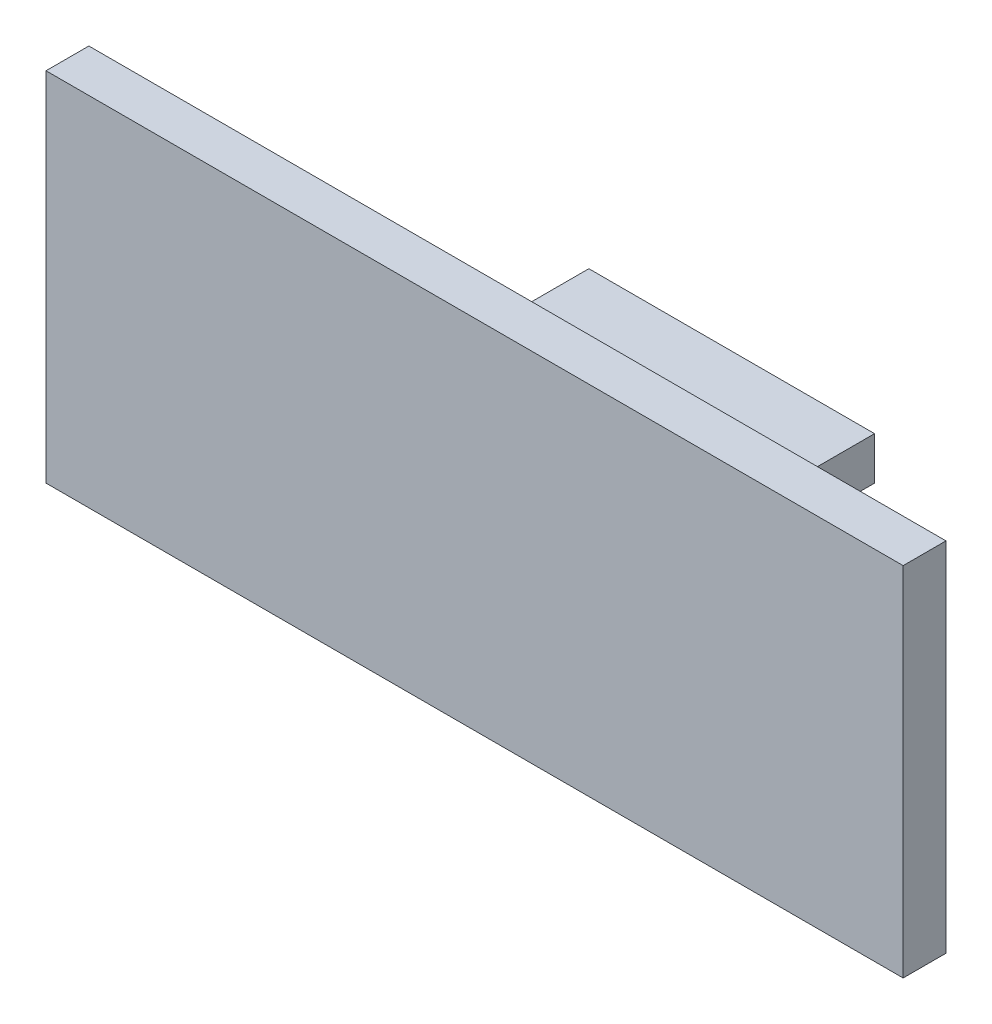
ISO-10303-21;
HEADER;
FILE_DESCRIPTION(('STEP AP214'),'2;1');
FILE_NAME('part.step','',(''),(''),'','','');
FILE_SCHEMA(('AUTOMOTIVE_DESIGN { 1 0 10303 214 1 1 1 1 }'));
ENDSEC;
DATA;
#1=APPLICATION_CONTEXT('core data for automotive mechanical design processes');
#2=APPLICATION_PROTOCOL_DEFINITION('international standard','automotive_design',2000,#1);
#3=PRODUCT_CONTEXT('',#1,'mechanical');
#4=PRODUCT('Part','Part','',(#3));
#5=PRODUCT_RELATED_PRODUCT_CATEGORY('part','',(#4));
#6=PRODUCT_DEFINITION_FORMATION('','',#4);
#7=PRODUCT_DEFINITION_CONTEXT('part definition',#1,'design');
#8=PRODUCT_DEFINITION('design','',#6,#7);
#9=PRODUCT_DEFINITION_SHAPE('','',#8);
#10=(LENGTH_UNIT() NAMED_UNIT(*) SI_UNIT(.MILLI.,.METRE.));
#11=(NAMED_UNIT(*) PLANE_ANGLE_UNIT() SI_UNIT($,.RADIAN.));
#12=(NAMED_UNIT(*) SI_UNIT($,.STERADIAN.) SOLID_ANGLE_UNIT());
#13=UNCERTAINTY_MEASURE_WITH_UNIT(LENGTH_MEASURE(1.E-05),#10,'distance_accuracy_value','');
#14=(GEOMETRIC_REPRESENTATION_CONTEXT(3) GLOBAL_UNCERTAINTY_ASSIGNED_CONTEXT((#13)) GLOBAL_UNIT_ASSIGNED_CONTEXT((#10,
#11,#12)) REPRESENTATION_CONTEXT('',''));
#15=CARTESIAN_POINT('',(0.,0.,0.));
#16=DIRECTION('',(0.,0.,1.));
#17=DIRECTION('',(1.,0.,0.));
#18=AXIS2_PLACEMENT_3D('',#15,#16,#17);
#19=CARTESIAN_POINT('',(30.,12.5,5.));
#20=DIRECTION('',(-1.,0.,0.));
#21=DIRECTION('',(0.,0.,1.));
#22=AXIS2_PLACEMENT_3D('',#19,#20,#21);
#23=PLANE('',#22);
#24=DIRECTION('',(0.,1.,0.));
#25=VECTOR('',#24,1.);
#26=CARTESIAN_POINT('',(30.,-12.5,3.));
#27=LINE('',#26,#25);
#28=CARTESIAN_POINT('',(30.,-12.5,3.));
#29=VERTEX_POINT('',#28);
#30=CARTESIAN_POINT('',(30.,12.5,3.));
#31=VERTEX_POINT('',#30);
#32=EDGE_CURVE('E129',#29,#31,#27,.T.);
#33=ORIENTED_EDGE('',*,*,#32,.F.);
#34=DIRECTION('',(0.,0.,-1.));
#35=VECTOR('',#34,1.);
#36=CARTESIAN_POINT('',(30.,-12.5,5.));
#37=LINE('',#36,#35);
#38=CARTESIAN_POINT('',(30.,-12.5,0.));
#39=VERTEX_POINT('',#38);
#40=EDGE_CURVE('E156',#29,#39,#37,.T.);
#41=ORIENTED_EDGE('',*,*,#40,.T.);
#42=DIRECTION('',(0.,1.,0.));
#43=VECTOR('',#42,1.);
#44=CARTESIAN_POINT('',(30.,12.5,0.));
#45=LINE('',#44,#43);
#46=CARTESIAN_POINT('',(30.,12.5,0.));
#47=VERTEX_POINT('',#46);
#48=EDGE_CURVE('E144',#39,#47,#45,.T.);
#49=ORIENTED_EDGE('',*,*,#48,.T.);
#50=DIRECTION('',(0.,0.,-1.));
#51=VECTOR('',#50,1.);
#52=CARTESIAN_POINT('',(30.,12.5,5.));
#53=LINE('',#52,#51);
#54=EDGE_CURVE('E11',#31,#47,#53,.T.);
#55=ORIENTED_EDGE('',*,*,#54,.F.);
#56=EDGE_LOOP('',(#33,#41,#49,#55));
#57=FACE_BOUND('',#56,.T.);
#58=ADVANCED_FACE('F33',(#57),#23,.F.);
#59=CARTESIAN_POINT('',(-30.,12.5,5.));
#60=DIRECTION('',(0.,-1.,0.));
#61=DIRECTION('',(0.,0.,-1.));
#62=AXIS2_PLACEMENT_3D('',#59,#60,#61);
#63=PLANE('',#62);
#64=DIRECTION('',(-1.,0.,0.));
#65=VECTOR('',#64,1.);
#66=CARTESIAN_POINT('',(30.,12.5,3.));
#67=LINE('',#66,#65);
#68=CARTESIAN_POINT('',(-30.,12.5,3.));
#69=VERTEX_POINT('',#68);
#70=EDGE_CURVE('E131',#31,#69,#67,.T.);
#71=ORIENTED_EDGE('',*,*,#70,.F.);
#72=ORIENTED_EDGE('',*,*,#54,.T.);
#73=DIRECTION('',(-1.,0.,0.));
#74=VECTOR('',#73,1.);
#75=CARTESIAN_POINT('',(-30.,12.5,0.));
#76=LINE('',#75,#74);
#77=CARTESIAN_POINT('',(-30.,12.5,0.));
#78=VERTEX_POINT('',#77);
#79=EDGE_CURVE('E147',#47,#78,#76,.T.);
#80=ORIENTED_EDGE('',*,*,#79,.T.);
#81=DIRECTION('',(0.,0.,-1.));
#82=VECTOR('',#81,1.);
#83=CARTESIAN_POINT('',(-30.,12.5,5.));
#84=LINE('',#83,#82);
#85=EDGE_CURVE('E40',#69,#78,#84,.T.);
#86=ORIENTED_EDGE('',*,*,#85,.F.);
#87=EDGE_LOOP('',(#71,#72,#80,#86));
#88=FACE_BOUND('',#87,.T.);
#89=ADVANCED_FACE('F168',(#88),#63,.F.);
#90=CARTESIAN_POINT('',(-30.,12.5,5.));
#91=DIRECTION('',(1.,0.,0.));
#92=DIRECTION('',(0.,1.,0.));
#93=AXIS2_PLACEMENT_3D('',#90,#91,#92);
#94=PLANE('',#93);
#95=DIRECTION('',(0.,-1.,0.));
#96=VECTOR('',#95,1.);
#97=CARTESIAN_POINT('',(-30.,-12.5,3.));
#98=LINE('',#97,#96);
#99=CARTESIAN_POINT('',(-30.,-12.5,3.));
#100=VERTEX_POINT('',#99);
#101=EDGE_CURVE('E47',#69,#100,#98,.T.);
#102=ORIENTED_EDGE('',*,*,#101,.F.);
#103=ORIENTED_EDGE('',*,*,#85,.T.);
#104=DIRECTION('',(0.,-1.,0.));
#105=VECTOR('',#104,1.);
#106=CARTESIAN_POINT('',(-30.,12.5,0.));
#107=LINE('',#106,#105);
#108=CARTESIAN_POINT('',(-30.,-12.5,0.));
#109=VERTEX_POINT('',#108);
#110=EDGE_CURVE('E150',#78,#109,#107,.T.);
#111=ORIENTED_EDGE('',*,*,#110,.T.);
#112=DIRECTION('',(0.,0.,-1.));
#113=VECTOR('',#112,1.);
#114=CARTESIAN_POINT('',(-30.,-12.5,5.));
#115=LINE('',#114,#113);
#116=EDGE_CURVE('E158',#100,#109,#115,.T.);
#117=ORIENTED_EDGE('',*,*,#116,.F.);
#118=EDGE_LOOP('',(#102,#103,#111,#117));
#119=FACE_BOUND('',#118,.T.);
#120=ADVANCED_FACE('F161',(#119),#94,.F.);
#121=CARTESIAN_POINT('',(-30.,-12.5,5.));
#122=DIRECTION('',(0.,1.,0.));
#123=DIRECTION('',(0.,0.,1.));
#124=AXIS2_PLACEMENT_3D('',#121,#122,#123);
#125=PLANE('',#124);
#126=DIRECTION('',(1.,0.,0.));
#127=VECTOR('',#126,1.);
#128=CARTESIAN_POINT('',(30.,-12.5,3.));
#129=LINE('',#128,#127);
#130=EDGE_CURVE('E127',#100,#29,#129,.T.);
#131=ORIENTED_EDGE('',*,*,#130,.F.);
#132=ORIENTED_EDGE('',*,*,#116,.T.);
#133=DIRECTION('',(1.,0.,0.));
#134=VECTOR('',#133,1.);
#135=CARTESIAN_POINT('',(-30.,-12.5,0.));
#136=LINE('',#135,#134);
#137=EDGE_CURVE('E153',#109,#39,#136,.T.);
#138=ORIENTED_EDGE('',*,*,#137,.T.);
#139=ORIENTED_EDGE('',*,*,#40,.F.);
#140=EDGE_LOOP('',(#131,#132,#138,#139));
#141=FACE_BOUND('',#140,.T.);
#142=ADVANCED_FACE('F175',(#141),#125,.F.);
#143=CARTESIAN_POINT('',(0.,0.,0.));
#144=DIRECTION('',(0.,0.,1.));
#145=DIRECTION('',(1.,0.,0.));
#146=AXIS2_PLACEMENT_3D('',#143,#144,#145);
#147=PLANE('',#146);
#148=ORIENTED_EDGE('',*,*,#48,.F.);
#149=ORIENTED_EDGE('',*,*,#137,.F.);
#150=ORIENTED_EDGE('',*,*,#110,.F.);
#151=ORIENTED_EDGE('',*,*,#79,.F.);
#152=EDGE_LOOP('',(#148,#149,#150,#151));
#153=FACE_BOUND('',#152,.T.);
#154=DIRECTION('',(0.,1.,0.));
#155=VECTOR('',#154,1.);
#156=CARTESIAN_POINT('',(-10.,1.5,0.));
#157=LINE('',#156,#155);
#158=CARTESIAN_POINT('',(-10.,-1.5,0.));
#159=VERTEX_POINT('',#158);
#160=CARTESIAN_POINT('',(-10.,1.5,0.));
#161=VERTEX_POINT('',#160);
#162=EDGE_CURVE('E133',#159,#161,#157,.T.);
#163=ORIENTED_EDGE('',*,*,#162,.F.);
#164=DIRECTION('',(-1.,0.,0.));
#165=VECTOR('',#164,1.);
#166=CARTESIAN_POINT('',(10.,-1.5,0.));
#167=LINE('',#166,#165);
#168=CARTESIAN_POINT('',(10.,-1.5,0.));
#169=VERTEX_POINT('',#168);
#170=EDGE_CURVE('E138',#169,#159,#167,.T.);
#171=ORIENTED_EDGE('',*,*,#170,.F.);
#172=DIRECTION('',(0.,-1.,0.));
#173=VECTOR('',#172,1.);
#174=CARTESIAN_POINT('',(10.,1.5,0.));
#175=LINE('',#174,#173);
#176=CARTESIAN_POINT('',(10.,1.5,0.));
#177=VERTEX_POINT('',#176);
#178=EDGE_CURVE('E103',#177,#169,#175,.T.);
#179=ORIENTED_EDGE('',*,*,#178,.F.);
#180=DIRECTION('',(1.,0.,0.));
#181=VECTOR('',#180,1.);
#182=CARTESIAN_POINT('',(10.,1.5,0.));
#183=LINE('',#182,#181);
#184=EDGE_CURVE('E55',#161,#177,#183,.T.);
#185=ORIENTED_EDGE('',*,*,#184,.F.);
#186=EDGE_LOOP('',(#163,#171,#179,#185));
#187=FACE_BOUND('',#186,.T.);
#188=ADVANCED_FACE('F172',(#153,#187),#147,.F.);
#189=CARTESIAN_POINT('',(-10.,1.5,-10.));
#190=DIRECTION('',(1.,0.,0.));
#191=DIRECTION('',(0.,0.,-1.));
#192=AXIS2_PLACEMENT_3D('',#189,#190,#191);
#193=PLANE('',#192);
#194=ORIENTED_EDGE('',*,*,#162,.T.);
#195=DIRECTION('',(0.,0.,1.));
#196=VECTOR('',#195,1.);
#197=CARTESIAN_POINT('',(-10.,1.5,-10.));
#198=LINE('',#197,#196);
#199=CARTESIAN_POINT('',(-10.,1.5,-15.));
#200=VERTEX_POINT('',#199);
#201=EDGE_CURVE('E142',#200,#161,#198,.T.);
#202=ORIENTED_EDGE('',*,*,#201,.F.);
#203=DIRECTION('',(0.,1.,0.));
#204=VECTOR('',#203,1.);
#205=CARTESIAN_POINT('',(-10.,1.5,-15.));
#206=LINE('',#205,#204);
#207=CARTESIAN_POINT('',(-10.,-1.5,-15.));
#208=VERTEX_POINT('',#207);
#209=EDGE_CURVE('E116',#208,#200,#206,.T.);
#210=ORIENTED_EDGE('',*,*,#209,.F.);
#211=DIRECTION('',(0.,0.,1.));
#212=VECTOR('',#211,1.);
#213=CARTESIAN_POINT('',(-10.,-1.5,-10.));
#214=LINE('',#213,#212);
#215=EDGE_CURVE('E107',#208,#159,#214,.T.);
#216=ORIENTED_EDGE('',*,*,#215,.T.);
#217=EDGE_LOOP('',(#194,#202,#210,#216));
#218=FACE_BOUND('',#217,.T.);
#219=ADVANCED_FACE('F192',(#218),#193,.F.);
#220=CARTESIAN_POINT('',(10.,1.5,-10.));
#221=DIRECTION('',(0.,-1.,0.));
#222=DIRECTION('',(0.,0.,-1.));
#223=AXIS2_PLACEMENT_3D('',#220,#221,#222);
#224=PLANE('',#223);
#225=ORIENTED_EDGE('',*,*,#184,.T.);
#226=DIRECTION('',(0.,0.,1.));
#227=VECTOR('',#226,1.);
#228=CARTESIAN_POINT('',(10.,1.5,-10.));
#229=LINE('',#228,#227);
#230=CARTESIAN_POINT('',(10.,1.5,-15.));
#231=VERTEX_POINT('',#230);
#232=EDGE_CURVE('E106',#231,#177,#229,.T.);
#233=ORIENTED_EDGE('',*,*,#232,.F.);
#234=DIRECTION('',(1.,0.,0.));
#235=VECTOR('',#234,1.);
#236=CARTESIAN_POINT('',(10.,1.5,-15.));
#237=LINE('',#236,#235);
#238=EDGE_CURVE('E121',#200,#231,#237,.T.);
#239=ORIENTED_EDGE('',*,*,#238,.F.);
#240=ORIENTED_EDGE('',*,*,#201,.T.);
#241=EDGE_LOOP('',(#225,#233,#239,#240));
#242=FACE_BOUND('',#241,.T.);
#243=ADVANCED_FACE('F195',(#242),#224,.F.);
#244=CARTESIAN_POINT('',(10.,1.5,-10.));
#245=DIRECTION('',(-1.,0.,0.));
#246=DIRECTION('',(0.,-1.,0.));
#247=AXIS2_PLACEMENT_3D('',#244,#245,#246);
#248=PLANE('',#247);
#249=ORIENTED_EDGE('',*,*,#178,.T.);
#250=DIRECTION('',(0.,0.,1.));
#251=VECTOR('',#250,1.);
#252=CARTESIAN_POINT('',(10.,-1.5,-10.));
#253=LINE('',#252,#251);
#254=CARTESIAN_POINT('',(10.,-1.5,-15.));
#255=VERTEX_POINT('',#254);
#256=EDGE_CURVE('E97',#255,#169,#253,.T.);
#257=ORIENTED_EDGE('',*,*,#256,.F.);
#258=DIRECTION('',(0.,-1.,0.));
#259=VECTOR('',#258,1.);
#260=CARTESIAN_POINT('',(10.,1.5,-15.));
#261=LINE('',#260,#259);
#262=EDGE_CURVE('E102',#231,#255,#261,.T.);
#263=ORIENTED_EDGE('',*,*,#262,.F.);
#264=ORIENTED_EDGE('',*,*,#232,.T.);
#265=EDGE_LOOP('',(#249,#257,#263,#264));
#266=FACE_BOUND('',#265,.T.);
#267=ADVANCED_FACE('F99',(#266),#248,.F.);
#268=CARTESIAN_POINT('',(10.,-1.5,-10.));
#269=DIRECTION('',(0.,1.,0.));
#270=DIRECTION('',(0.,0.,1.));
#271=AXIS2_PLACEMENT_3D('',#268,#269,#270);
#272=PLANE('',#271);
#273=ORIENTED_EDGE('',*,*,#170,.T.);
#274=ORIENTED_EDGE('',*,*,#215,.F.);
#275=DIRECTION('',(-1.,0.,0.));
#276=VECTOR('',#275,1.);
#277=CARTESIAN_POINT('',(10.,-1.5,-15.));
#278=LINE('',#277,#276);
#279=EDGE_CURVE('E110',#255,#208,#278,.T.);
#280=ORIENTED_EDGE('',*,*,#279,.F.);
#281=ORIENTED_EDGE('',*,*,#256,.T.);
#282=EDGE_LOOP('',(#273,#274,#280,#281));
#283=FACE_BOUND('',#282,.T.);
#284=ADVANCED_FACE('F111',(#283),#272,.F.);
#285=CARTESIAN_POINT('',(0.,0.,3.));
#286=DIRECTION('',(0.,0.,1.));
#287=DIRECTION('',(1.,0.,0.));
#288=AXIS2_PLACEMENT_3D('',#285,#286,#287);
#289=PLANE('',#288);
#290=ORIENTED_EDGE('',*,*,#101,.T.);
#291=ORIENTED_EDGE('',*,*,#130,.T.);
#292=ORIENTED_EDGE('',*,*,#32,.T.);
#293=ORIENTED_EDGE('',*,*,#70,.T.);
#294=EDGE_LOOP('',(#290,#291,#292,#293));
#295=FACE_BOUND('',#294,.T.);
#296=ADVANCED_FACE('F177',(#295),#289,.T.);
#297=CARTESIAN_POINT('',(0.,0.,-15.));
#298=DIRECTION('',(0.,0.,-1.));
#299=DIRECTION('',(-1.,0.,0.));
#300=AXIS2_PLACEMENT_3D('',#297,#298,#299);
#301=PLANE('',#300);
#302=ORIENTED_EDGE('',*,*,#262,.T.);
#303=ORIENTED_EDGE('',*,*,#279,.T.);
#304=ORIENTED_EDGE('',*,*,#209,.T.);
#305=ORIENTED_EDGE('',*,*,#238,.T.);
#306=EDGE_LOOP('',(#302,#303,#304,#305));
#307=FACE_BOUND('',#306,.T.);
#308=ADVANCED_FACE('F119',(#307),#301,.T.);
#309=CLOSED_SHELL('',(#58,#89,#120,#142,#188,#219,#243,#267,#284,#296,#308));
#310=MANIFOLD_SOLID_BREP('B2',#309);
#311=ADVANCED_BREP_SHAPE_REPRESENTATION('',(#18,#310),#14);
#312=SHAPE_DEFINITION_REPRESENTATION(#9,#311);
ENDSEC;
END-ISO-10303-21;
